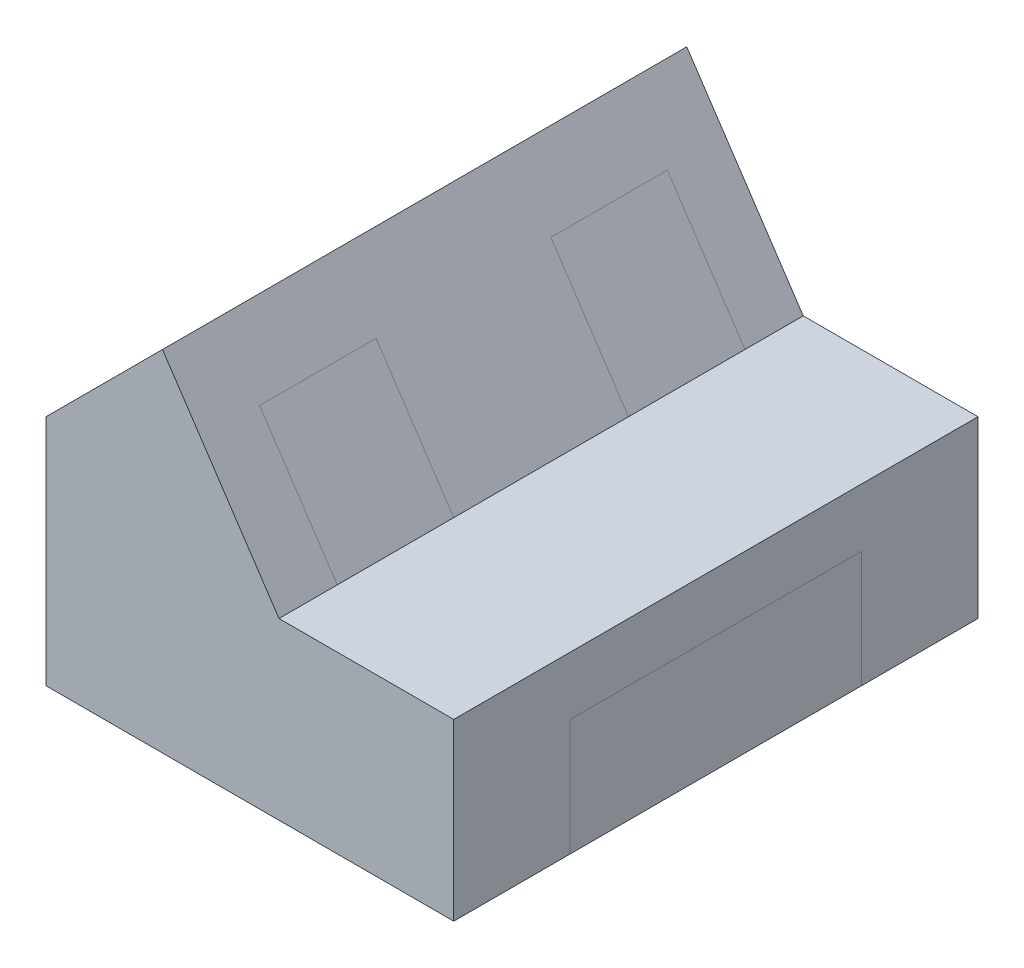
ISO-10303-21;
HEADER;
FILE_DESCRIPTION(('STEP AP214'),'2;1');
FILE_NAME('part.step','',(''),(''),'','','');
FILE_SCHEMA(('AUTOMOTIVE_DESIGN { 1 0 10303 214 1 1 1 1 }'));
ENDSEC;
DATA;
#1=APPLICATION_CONTEXT('core data for automotive mechanical design processes');
#2=APPLICATION_PROTOCOL_DEFINITION('international standard','automotive_design',2000,#1);
#3=PRODUCT_CONTEXT('',#1,'mechanical');
#4=PRODUCT('Part','Part','',(#3));
#5=PRODUCT_RELATED_PRODUCT_CATEGORY('part','',(#4));
#6=PRODUCT_DEFINITION_FORMATION('','',#4);
#7=PRODUCT_DEFINITION_CONTEXT('part definition',#1,'design');
#8=PRODUCT_DEFINITION('design','',#6,#7);
#9=PRODUCT_DEFINITION_SHAPE('','',#8);
#10=(LENGTH_UNIT() NAMED_UNIT(*) SI_UNIT(.MILLI.,.METRE.));
#11=(NAMED_UNIT(*) PLANE_ANGLE_UNIT() SI_UNIT($,.RADIAN.));
#12=(NAMED_UNIT(*) SI_UNIT($,.STERADIAN.) SOLID_ANGLE_UNIT());
#13=UNCERTAINTY_MEASURE_WITH_UNIT(LENGTH_MEASURE(1.E-05),#10,'distance_accuracy_value','');
#14=(GEOMETRIC_REPRESENTATION_CONTEXT(3) GLOBAL_UNCERTAINTY_ASSIGNED_CONTEXT((#13)) GLOBAL_UNIT_ASSIGNED_CONTEXT((#10,
#11,#12)) REPRESENTATION_CONTEXT('',''));
#15=CARTESIAN_POINT('',(0.,0.,0.));
#16=DIRECTION('',(0.,0.,1.));
#17=DIRECTION('',(1.,0.,0.));
#18=AXIS2_PLACEMENT_3D('',#15,#16,#17);
#19=CARTESIAN_POINT('',(70.,0.,0.));
#20=DIRECTION('',(1.,0.,0.));
#21=DIRECTION('',(0.,0.,-1.));
#22=AXIS2_PLACEMENT_3D('',#19,#20,#21);
#23=PLANE('',#22);
#24=DIRECTION('',(0.,0.,-1.));
#25=VECTOR('',#24,1.);
#26=CARTESIAN_POINT('',(70.,0.,70.));
#27=LINE('',#26,#25);
#28=CARTESIAN_POINT('',(70.,0.,70.));
#29=VERTEX_POINT('',#28);
#30=CARTESIAN_POINT('',(70.,0.,20.));
#31=VERTEX_POINT('',#30);
#32=EDGE_CURVE('E55',#29,#31,#27,.T.);
#33=ORIENTED_EDGE('',*,*,#32,.T.);
#34=DIRECTION('',(0.,1.,0.));
#35=VECTOR('',#34,1.);
#36=CARTESIAN_POINT('',(70.,0.,20.));
#37=LINE('',#36,#35);
#38=CARTESIAN_POINT('',(70.,20.,20.));
#39=VERTEX_POINT('',#38);
#40=EDGE_CURVE('E66',#31,#39,#37,.T.);
#41=ORIENTED_EDGE('',*,*,#40,.T.);
#42=DIRECTION('',(0.,0.,-1.));
#43=VECTOR('',#42,1.);
#44=CARTESIAN_POINT('',(70.,20.,70.));
#45=LINE('',#44,#43);
#46=CARTESIAN_POINT('',(70.,20.,70.));
#47=VERTEX_POINT('',#46);
#48=EDGE_CURVE('E51',#47,#39,#45,.T.);
#49=ORIENTED_EDGE('',*,*,#48,.F.);
#50=DIRECTION('',(0.,1.,0.));
#51=VECTOR('',#50,1.);
#52=CARTESIAN_POINT('',(70.,0.,70.));
#53=LINE('',#52,#51);
#54=EDGE_CURVE('E12',#29,#47,#53,.T.);
#55=ORIENTED_EDGE('',*,*,#54,.F.);
#56=EDGE_LOOP('',(#33,#41,#49,#55));
#57=FACE_BOUND('',#56,.T.);
#58=ADVANCED_FACE('F46',(#57),#23,.T.);
#59=OPEN_SHELL('',(#58));
#60=SHELL_BASED_SURFACE_MODEL('B2',(#59));
#61=CARTESIAN_POINT('',(70.,30.,90.));
#62=DIRECTION('',(-1.,0.,0.));
#63=DIRECTION('',(0.,0.,1.));
#64=AXIS2_PLACEMENT_3D('',#61,#62,#63);
#65=PLANE('',#64);
#66=DIRECTION('',(0.,-1.,0.));
#67=VECTOR('',#66,1.);
#68=CARTESIAN_POINT('',(70.,30.,70.));
#69=LINE('',#68,#67);
#70=CARTESIAN_POINT('',(70.,20.,70.));
#71=VERTEX_POINT('',#70);
#72=CARTESIAN_POINT('',(70.,0.,70.));
#73=VERTEX_POINT('',#72);
#74=EDGE_CURVE('E44',#71,#73,#69,.T.);
#75=ORIENTED_EDGE('',*,*,#74,.F.);
#76=DIRECTION('',(0.,0.,1.));
#77=VECTOR('',#76,1.);
#78=CARTESIAN_POINT('',(70.,20.,90.));
#79=LINE('',#78,#77);
#80=CARTESIAN_POINT('',(70.,20.,20.));
#81=VERTEX_POINT('',#80);
#82=EDGE_CURVE('E290',#81,#71,#79,.T.);
#83=ORIENTED_EDGE('',*,*,#82,.F.);
#84=DIRECTION('',(0.,1.,0.));
#85=VECTOR('',#84,1.);
#86=CARTESIAN_POINT('',(70.,30.,20.));
#87=LINE('',#86,#85);
#88=CARTESIAN_POINT('',(70.,0.,20.));
#89=VERTEX_POINT('',#88);
#90=EDGE_CURVE('E97',#89,#81,#87,.T.);
#91=ORIENTED_EDGE('',*,*,#90,.F.);
#92=DIRECTION('',(0.,0.,-1.));
#93=VECTOR('',#92,1.);
#94=CARTESIAN_POINT('',(70.,0.,90.));
#95=LINE('',#94,#93);
#96=CARTESIAN_POINT('',(70.,0.,0.));
#97=VERTEX_POINT('',#96);
#98=EDGE_CURVE('E199',#89,#97,#95,.T.);
#99=ORIENTED_EDGE('',*,*,#98,.T.);
#100=DIRECTION('',(0.,1.,0.));
#101=VECTOR('',#100,1.);
#102=CARTESIAN_POINT('',(70.,30.,0.));
#103=LINE('',#102,#101);
#104=CARTESIAN_POINT('',(70.,30.,0.));
#105=VERTEX_POINT('',#104);
#106=EDGE_CURVE('E230',#97,#105,#103,.T.);
#107=ORIENTED_EDGE('',*,*,#106,.T.);
#108=DIRECTION('',(0.,0.,-1.));
#109=VECTOR('',#108,1.);
#110=CARTESIAN_POINT('',(70.,30.,90.));
#111=LINE('',#110,#109);
#112=CARTESIAN_POINT('',(70.,30.,90.));
#113=VERTEX_POINT('',#112);
#114=EDGE_CURVE('E178',#113,#105,#111,.T.);
#115=ORIENTED_EDGE('',*,*,#114,.F.);
#116=DIRECTION('',(0.,1.,0.));
#117=VECTOR('',#116,1.);
#118=CARTESIAN_POINT('',(70.,30.,90.));
#119=LINE('',#118,#117);
#120=CARTESIAN_POINT('',(70.,0.,90.));
#121=VERTEX_POINT('',#120);
#122=EDGE_CURVE('E173',#121,#113,#119,.T.);
#123=ORIENTED_EDGE('',*,*,#122,.F.);
#124=EDGE_CURVE('E176',#121,#73,#95,.T.);
#125=ORIENTED_EDGE('',*,*,#124,.T.);
#126=EDGE_LOOP('',(#75,#83,#91,#99,#107,#115,#123,#125));
#127=FACE_BOUND('',#126,.T.);
#128=ADVANCED_FACE('F88',(#127),#65,.F.);
#129=CARTESIAN_POINT('',(20.,60.,90.));
#130=DIRECTION('',(-0.832050294337843,-0.554700196225229,0.));
#131=DIRECTION('',(0.554700196225229,-0.832050294337844,0.));
#132=AXIS2_PLACEMENT_3D('',#129,#130,#131);
#133=PLANE('',#132);
#134=DIRECTION('',(0.554700196225229,-0.832050294337844,0.));
#135=VECTOR('',#134,1.);
#136=CARTESIAN_POINT('',(20.,60.,30.));
#137=LINE('',#136,#135);
#138=CARTESIAN_POINT('',(26.6666666666667,50.,30.));
#139=VERTEX_POINT('',#138);
#140=CARTESIAN_POINT('',(40.,30.,30.));
#141=VERTEX_POINT('',#140);
#142=EDGE_CURVE('E270',#139,#141,#137,.T.);
#143=ORIENTED_EDGE('',*,*,#142,.F.);
#144=DIRECTION('',(0.,0.,1.));
#145=VECTOR('',#144,1.);
#146=CARTESIAN_POINT('',(26.6666666666667,50.,90.));
#147=LINE('',#146,#145);
#148=CARTESIAN_POINT('',(26.6666666666667,50.,9.99999999999999));
#149=VERTEX_POINT('',#148);
#150=EDGE_CURVE('E277',#149,#139,#147,.T.);
#151=ORIENTED_EDGE('',*,*,#150,.F.);
#152=DIRECTION('',(-0.554700196225229,0.832050294337844,0.));
#153=VECTOR('',#152,1.);
#154=CARTESIAN_POINT('',(20.,60.,9.99999999999999));
#155=LINE('',#154,#153);
#156=CARTESIAN_POINT('',(40.,30.,10.));
#157=VERTEX_POINT('',#156);
#158=EDGE_CURVE('E268',#157,#149,#155,.T.);
#159=ORIENTED_EDGE('',*,*,#158,.F.);
#160=DIRECTION('',(0.,0.,-1.));
#161=VECTOR('',#160,1.);
#162=CARTESIAN_POINT('',(40.,30.,90.));
#163=LINE('',#162,#161);
#164=CARTESIAN_POINT('',(40.,30.,0.));
#165=VERTEX_POINT('',#164);
#166=EDGE_CURVE('E213',#157,#165,#163,.T.);
#167=ORIENTED_EDGE('',*,*,#166,.T.);
#168=DIRECTION('',(-0.554700196225229,0.832050294337844,0.));
#169=VECTOR('',#168,1.);
#170=CARTESIAN_POINT('',(20.,60.,0.));
#171=LINE('',#170,#169);
#172=CARTESIAN_POINT('',(20.,60.,0.));
#173=VERTEX_POINT('',#172);
#174=EDGE_CURVE('E226',#165,#173,#171,.T.);
#175=ORIENTED_EDGE('',*,*,#174,.T.);
#176=DIRECTION('',(0.,0.,-1.));
#177=VECTOR('',#176,1.);
#178=CARTESIAN_POINT('',(20.,60.,90.));
#179=LINE('',#178,#177);
#180=CARTESIAN_POINT('',(20.,60.,90.));
#181=VERTEX_POINT('',#180);
#182=EDGE_CURVE('E215',#181,#173,#179,.T.);
#183=ORIENTED_EDGE('',*,*,#182,.F.);
#184=DIRECTION('',(-0.554700196225229,0.832050294337844,0.));
#185=VECTOR('',#184,1.);
#186=CARTESIAN_POINT('',(20.,60.,90.));
#187=LINE('',#186,#185);
#188=CARTESIAN_POINT('',(40.,30.,90.));
#189=VERTEX_POINT('',#188);
#190=EDGE_CURVE('E237',#189,#181,#187,.T.);
#191=ORIENTED_EDGE('',*,*,#190,.F.);
#192=CARTESIAN_POINT('',(40.,30.,80.));
#193=VERTEX_POINT('',#192);
#194=EDGE_CURVE('E206',#189,#193,#163,.T.);
#195=ORIENTED_EDGE('',*,*,#194,.T.);
#196=DIRECTION('',(0.554700196225229,-0.832050294337844,0.));
#197=VECTOR('',#196,1.);
#198=CARTESIAN_POINT('',(20.,60.,80.));
#199=LINE('',#198,#197);
#200=CARTESIAN_POINT('',(26.6666666666667,50.,80.));
#201=VERTEX_POINT('',#200);
#202=EDGE_CURVE('E275',#201,#193,#199,.T.);
#203=ORIENTED_EDGE('',*,*,#202,.F.);
#204=DIRECTION('',(0.,0.,1.));
#205=VECTOR('',#204,1.);
#206=CARTESIAN_POINT('',(26.6666666666667,50.,90.));
#207=LINE('',#206,#205);
#208=CARTESIAN_POINT('',(26.6666666666667,50.,60.));
#209=VERTEX_POINT('',#208);
#210=EDGE_CURVE('E197',#209,#201,#207,.T.);
#211=ORIENTED_EDGE('',*,*,#210,.F.);
#212=DIRECTION('',(-0.554700196225229,0.832050294337844,0.));
#213=VECTOR('',#212,1.);
#214=CARTESIAN_POINT('',(20.,60.,60.));
#215=LINE('',#214,#213);
#216=CARTESIAN_POINT('',(40.,30.,60.));
#217=VERTEX_POINT('',#216);
#218=EDGE_CURVE('E202',#217,#209,#215,.T.);
#219=ORIENTED_EDGE('',*,*,#218,.F.);
#220=EDGE_CURVE('E271',#217,#141,#163,.T.);
#221=ORIENTED_EDGE('',*,*,#220,.T.);
#222=EDGE_LOOP('',(#143,#151,#159,#167,#175,#183,#191,#195,#203,#211,#219,#221));
#223=FACE_BOUND('',#222,.T.);
#224=ADVANCED_FACE('F247',(#223),#133,.F.);
#225=ORIENTED_EDGE('',*,*,#150,.T.);
#226=ORIENTED_EDGE('',*,*,#142,.T.);
#227=EDGE_CURVE('E263',#141,#157,#163,.T.);
#228=ORIENTED_EDGE('',*,*,#227,.T.);
#229=ORIENTED_EDGE('',*,*,#158,.T.);
#230=EDGE_LOOP('',(#225,#226,#228,#229));
#231=FACE_BOUND('',#230,.T.);
#232=ADVANCED_FACE('F267',(#231),#133,.F.);
#233=CARTESIAN_POINT('',(70.,0.,90.));
#234=DIRECTION('',(0.,1.,0.));
#235=DIRECTION('',(-1.,0.,0.));
#236=AXIS2_PLACEMENT_3D('',#233,#234,#235);
#237=PLANE('',#236);
#238=DIRECTION('',(1.,0.,0.));
#239=VECTOR('',#238,1.);
#240=CARTESIAN_POINT('',(70.,0.,0.));
#241=LINE('',#240,#239);
#242=CARTESIAN_POINT('',(0.,0.,0.));
#243=VERTEX_POINT('',#242);
#244=EDGE_CURVE('E232',#243,#97,#241,.T.);
#245=ORIENTED_EDGE('',*,*,#244,.T.);
#246=ORIENTED_EDGE('',*,*,#98,.F.);
#247=EDGE_CURVE('E196',#73,#89,#95,.T.);
#248=ORIENTED_EDGE('',*,*,#247,.F.);
#249=ORIENTED_EDGE('',*,*,#124,.F.);
#250=DIRECTION('',(1.,0.,0.));
#251=VECTOR('',#250,1.);
#252=CARTESIAN_POINT('',(70.,0.,90.));
#253=LINE('',#252,#251);
#254=CARTESIAN_POINT('',(0.,0.,90.));
#255=VERTEX_POINT('',#254);
#256=EDGE_CURVE('E182',#255,#121,#253,.T.);
#257=ORIENTED_EDGE('',*,*,#256,.F.);
#258=DIRECTION('',(0.,0.,-1.));
#259=VECTOR('',#258,1.);
#260=CARTESIAN_POINT('',(0.,0.,90.));
#261=LINE('',#260,#259);
#262=EDGE_CURVE('E221',#255,#243,#261,.T.);
#263=ORIENTED_EDGE('',*,*,#262,.T.);
#264=EDGE_LOOP('',(#245,#246,#248,#249,#257,#263));
#265=FACE_BOUND('',#264,.T.);
#266=ADVANCED_FACE('F90',(#265),#237,.F.);
#267=ORIENTED_EDGE('',*,*,#82,.T.);
#268=ORIENTED_EDGE('',*,*,#74,.T.);
#269=ORIENTED_EDGE('',*,*,#247,.T.);
#270=ORIENTED_EDGE('',*,*,#90,.T.);
#271=EDGE_LOOP('',(#267,#268,#269,#270));
#272=FACE_BOUND('',#271,.T.);
#273=ADVANCED_FACE('F307',(#272),#65,.F.);
#274=CARTESIAN_POINT('',(40.,30.,90.));
#275=DIRECTION('',(0.,-1.,0.));
#276=DIRECTION('',(0.,0.,-1.));
#277=AXIS2_PLACEMENT_3D('',#274,#275,#276);
#278=PLANE('',#277);
#279=DIRECTION('',(-1.,0.,0.));
#280=VECTOR('',#279,1.);
#281=CARTESIAN_POINT('',(40.,30.,0.));
#282=LINE('',#281,#280);
#283=EDGE_CURVE('E228',#105,#165,#282,.T.);
#284=ORIENTED_EDGE('',*,*,#283,.T.);
#285=ORIENTED_EDGE('',*,*,#166,.F.);
#286=ORIENTED_EDGE('',*,*,#227,.F.);
#287=ORIENTED_EDGE('',*,*,#220,.F.);
#288=EDGE_CURVE('E211',#193,#217,#163,.T.);
#289=ORIENTED_EDGE('',*,*,#288,.F.);
#290=ORIENTED_EDGE('',*,*,#194,.F.);
#291=DIRECTION('',(-1.,0.,0.));
#292=VECTOR('',#291,1.);
#293=CARTESIAN_POINT('',(40.,30.,90.));
#294=LINE('',#293,#292);
#295=EDGE_CURVE('E181',#113,#189,#294,.T.);
#296=ORIENTED_EDGE('',*,*,#295,.F.);
#297=ORIENTED_EDGE('',*,*,#114,.T.);
#298=EDGE_LOOP('',(#284,#285,#286,#287,#289,#290,#296,#297));
#299=FACE_BOUND('',#298,.T.);
#300=ADVANCED_FACE('F243',(#299),#278,.F.);
#301=ORIENTED_EDGE('',*,*,#210,.T.);
#302=ORIENTED_EDGE('',*,*,#202,.T.);
#303=ORIENTED_EDGE('',*,*,#288,.T.);
#304=ORIENTED_EDGE('',*,*,#218,.T.);
#305=EDGE_LOOP('',(#301,#302,#303,#304));
#306=FACE_BOUND('',#305,.T.);
#307=ADVANCED_FACE('F273',(#306),#133,.F.);
#308=CARTESIAN_POINT('',(0.,40.,90.));
#309=DIRECTION('',(0.707106781186547,-0.707106781186547,0.));
#310=DIRECTION('',(0.707106781186548,0.707106781186548,0.));
#311=AXIS2_PLACEMENT_3D('',#308,#309,#310);
#312=PLANE('',#311);
#313=DIRECTION('',(-0.707106781186548,-0.707106781186547,0.));
#314=VECTOR('',#313,1.);
#315=CARTESIAN_POINT('',(0.,40.,0.));
#316=LINE('',#315,#314);
#317=CARTESIAN_POINT('',(0.,40.,0.));
#318=VERTEX_POINT('',#317);
#319=EDGE_CURVE('E224',#173,#318,#316,.T.);
#320=ORIENTED_EDGE('',*,*,#319,.T.);
#321=DIRECTION('',(0.,0.,-1.));
#322=VECTOR('',#321,1.);
#323=CARTESIAN_POINT('',(0.,40.,90.));
#324=LINE('',#323,#322);
#325=CARTESIAN_POINT('',(0.,40.,90.));
#326=VERTEX_POINT('',#325);
#327=EDGE_CURVE('E218',#326,#318,#324,.T.);
#328=ORIENTED_EDGE('',*,*,#327,.F.);
#329=DIRECTION('',(-0.707106781186548,-0.707106781186547,0.));
#330=VECTOR('',#329,1.);
#331=CARTESIAN_POINT('',(0.,40.,90.));
#332=LINE('',#331,#330);
#333=EDGE_CURVE('E235',#181,#326,#332,.T.);
#334=ORIENTED_EDGE('',*,*,#333,.F.);
#335=ORIENTED_EDGE('',*,*,#182,.T.);
#336=EDGE_LOOP('',(#320,#328,#334,#335));
#337=FACE_BOUND('',#336,.T.);
#338=ADVANCED_FACE('F253',(#337),#312,.F.);
#339=CARTESIAN_POINT('',(0.,0.,90.));
#340=DIRECTION('',(1.,0.,0.));
#341=DIRECTION('',(0.,0.,-1.));
#342=AXIS2_PLACEMENT_3D('',#339,#340,#341);
#343=PLANE('',#342);
#344=DIRECTION('',(0.,-1.,0.));
#345=VECTOR('',#344,1.);
#346=CARTESIAN_POINT('',(0.,0.,0.));
#347=LINE('',#346,#345);
#348=EDGE_CURVE('E191',#318,#243,#347,.T.);
#349=ORIENTED_EDGE('',*,*,#348,.T.);
#350=ORIENTED_EDGE('',*,*,#262,.F.);
#351=DIRECTION('',(0.,-1.,0.));
#352=VECTOR('',#351,1.);
#353=CARTESIAN_POINT('',(0.,0.,90.));
#354=LINE('',#353,#352);
#355=EDGE_CURVE('E187',#326,#255,#354,.T.);
#356=ORIENTED_EDGE('',*,*,#355,.F.);
#357=ORIENTED_EDGE('',*,*,#327,.T.);
#358=EDGE_LOOP('',(#349,#350,#356,#357));
#359=FACE_BOUND('',#358,.T.);
#360=ADVANCED_FACE('F256',(#359),#343,.F.);
#361=CARTESIAN_POINT('',(0.,0.,90.));
#362=DIRECTION('',(0.,0.,-1.));
#363=DIRECTION('',(-1.,0.,0.));
#364=AXIS2_PLACEMENT_3D('',#361,#362,#363);
#365=PLANE('',#364);
#366=ORIENTED_EDGE('',*,*,#256,.T.);
#367=ORIENTED_EDGE('',*,*,#122,.T.);
#368=ORIENTED_EDGE('',*,*,#295,.T.);
#369=ORIENTED_EDGE('',*,*,#190,.T.);
#370=ORIENTED_EDGE('',*,*,#333,.T.);
#371=ORIENTED_EDGE('',*,*,#355,.T.);
#372=EDGE_LOOP('',(#366,#367,#368,#369,#370,#371));
#373=FACE_BOUND('',#372,.T.);
#374=ADVANCED_FACE('F185',(#373),#365,.F.);
#375=CARTESIAN_POINT('',(0.,0.,0.));
#376=DIRECTION('',(0.,0.,-1.));
#377=DIRECTION('',(-1.,0.,0.));
#378=AXIS2_PLACEMENT_3D('',#375,#376,#377);
#379=PLANE('',#378);
#380=ORIENTED_EDGE('',*,*,#244,.F.);
#381=ORIENTED_EDGE('',*,*,#348,.F.);
#382=ORIENTED_EDGE('',*,*,#319,.F.);
#383=ORIENTED_EDGE('',*,*,#174,.F.);
#384=ORIENTED_EDGE('',*,*,#283,.F.);
#385=ORIENTED_EDGE('',*,*,#106,.F.);
#386=EDGE_LOOP('',(#380,#381,#382,#383,#384,#385));
#387=FACE_BOUND('',#386,.T.);
#388=ADVANCED_FACE('F259',(#387),#379,.T.);
#389=CLOSED_SHELL('',(#128,#224,#232,#266,#273,#300,#307,#338,#360,#374,#388));
#390=MANIFOLD_SOLID_BREP('B6',#389);
#391=ADVANCED_BREP_SHAPE_REPRESENTATION('',(#18,#390),#14);
#392=MANIFOLD_SURFACE_SHAPE_REPRESENTATION('',(#18,#60),#14);
#393=SHAPE_REPRESENTATION('',(#18),#14);
#394=SHAPE_DEFINITION_REPRESENTATION(#9,#393);
#395=SHAPE_REPRESENTATION_RELATIONSHIP('','',#393,#391);
#396=SHAPE_REPRESENTATION_RELATIONSHIP('','',#393,#392);
ENDSEC;
END-ISO-10303-21;
